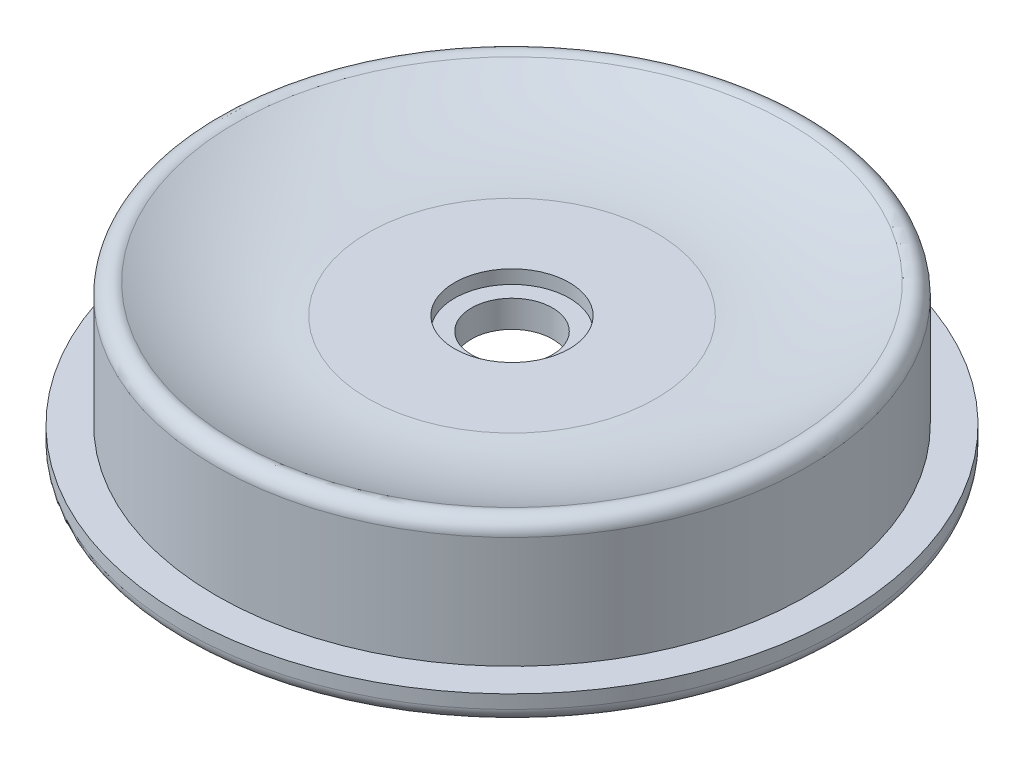
ISO-10303-21;
HEADER;
FILE_DESCRIPTION(('STEP AP214'),'2;1');
FILE_NAME('part.step','',(''),(''),'','','');
FILE_SCHEMA(('AUTOMOTIVE_DESIGN { 1 0 10303 214 1 1 1 1 }'));
ENDSEC;
DATA;
#1=APPLICATION_CONTEXT('core data for automotive mechanical design processes');
#2=APPLICATION_PROTOCOL_DEFINITION('international standard','automotive_design',2000,#1);
#3=PRODUCT_CONTEXT('',#1,'mechanical');
#4=PRODUCT('Part','Part','',(#3));
#5=PRODUCT_RELATED_PRODUCT_CATEGORY('part','',(#4));
#6=PRODUCT_DEFINITION_FORMATION('','',#4);
#7=PRODUCT_DEFINITION_CONTEXT('part definition',#1,'design');
#8=PRODUCT_DEFINITION('design','',#6,#7);
#9=PRODUCT_DEFINITION_SHAPE('','',#8);
#10=(LENGTH_UNIT() NAMED_UNIT(*) SI_UNIT(.MILLI.,.METRE.));
#11=(NAMED_UNIT(*) PLANE_ANGLE_UNIT() SI_UNIT($,.RADIAN.));
#12=(NAMED_UNIT(*) SI_UNIT($,.STERADIAN.) SOLID_ANGLE_UNIT());
#13=UNCERTAINTY_MEASURE_WITH_UNIT(LENGTH_MEASURE(1.E-05),#10,'distance_accuracy_value','');
#14=(GEOMETRIC_REPRESENTATION_CONTEXT(3) GLOBAL_UNCERTAINTY_ASSIGNED_CONTEXT((#13)) GLOBAL_UNIT_ASSIGNED_CONTEXT((#10,
#11,#12)) REPRESENTATION_CONTEXT('',''));
#15=CARTESIAN_POINT('',(0.,0.,0.));
#16=DIRECTION('',(0.,0.,1.));
#17=DIRECTION('',(1.,0.,0.));
#18=AXIS2_PLACEMENT_3D('',#15,#16,#17);
#19=CARTESIAN_POINT('',(48.8,4.,0.));
#20=DIRECTION('',(0.,-1.,0.));
#21=DIRECTION('',(0.,0.,-1.));
#22=AXIS2_PLACEMENT_3D('',#19,#20,#21);
#23=PLANE('',#22);
#24=CARTESIAN_POINT('',(0.,4.,0.));
#25=DIRECTION('',(0.,1.,0.));
#26=DIRECTION('',(0.,0.,1.));
#27=AXIS2_PLACEMENT_3D('',#24,#25,#26);
#28=CIRCLE('',#27,43.8);
#29=CARTESIAN_POINT('',(0.,4.,43.8));
#30=VERTEX_POINT('',#29);
#31=EDGE_CURVE('E50',#30,#30,#28,.T.);
#32=ORIENTED_EDGE('',*,*,#31,.F.);
#33=EDGE_LOOP('',(#32));
#34=FACE_BOUND('',#33,.T.);
#35=CARTESIAN_POINT('',(0.,4.,0.));
#36=DIRECTION('',(0.,1.,0.));
#37=DIRECTION('',(0.,0.,1.));
#38=AXIS2_PLACEMENT_3D('',#35,#36,#37);
#39=CIRCLE('',#38,48.8);
#40=CARTESIAN_POINT('',(0.,4.,48.8));
#41=VERTEX_POINT('',#40);
#42=EDGE_CURVE('E97',#41,#41,#39,.T.);
#43=ORIENTED_EDGE('',*,*,#42,.T.);
#44=EDGE_LOOP('',(#43));
#45=FACE_BOUND('',#44,.T.);
#46=ADVANCED_FACE('F37',(#34,#45),#23,.F.);
#47=CARTESIAN_POINT('',(0.,55.,0.));
#48=DIRECTION('',(0.,1.,0.));
#49=DIRECTION('',(0.,0.,1.));
#50=AXIS2_PLACEMENT_3D('',#47,#48,#49);
#51=CYLINDRICAL_SURFACE('',#50,43.8);
#52=CARTESIAN_POINT('',(0.,20.522937023034,0.));
#53=DIRECTION('',(0.,1.,0.));
#54=DIRECTION('',(0.,0.,1.));
#55=AXIS2_PLACEMENT_3D('',#52,#53,#54);
#56=CIRCLE('',#55,43.8);
#57=CARTESIAN_POINT('',(0.,20.522937023034,43.8));
#58=VERTEX_POINT('',#57);
#59=EDGE_CURVE('E55',#58,#58,#56,.T.);
#60=ORIENTED_EDGE('',*,*,#59,.F.);
#61=EDGE_LOOP('',(#60));
#62=FACE_BOUND('',#61,.T.);
#63=ORIENTED_EDGE('',*,*,#31,.T.);
#64=EDGE_LOOP('',(#63));
#65=FACE_BOUND('',#64,.T.);
#66=ADVANCED_FACE('F125',(#62,#65),#51,.T.);
#67=CARTESIAN_POINT('',(0.,20.522937023034,0.));
#68=DIRECTION('',(0.,1.,0.));
#69=DIRECTION('',(0.,0.,1.));
#70=AXIS2_PLACEMENT_3D('',#67,#68,#69);
#71=TOROIDAL_SURFACE('',#70,41.8,2.);
#72=CARTESIAN_POINT('',(0.,22.294338654817,0.));
#73=DIRECTION('',(0.,1.,0.));
#74=DIRECTION('',(0.,0.,1.));
#75=AXIS2_PLACEMENT_3D('',#72,#73,#74);
#76=CIRCLE('',#75,40.8714870712174);
#77=CARTESIAN_POINT('',(0.,22.294338654817,40.8714870712174));
#78=VERTEX_POINT('',#77);
#79=EDGE_CURVE('E61',#78,#78,#76,.T.);
#80=ORIENTED_EDGE('',*,*,#79,.F.);
#81=EDGE_LOOP('',(#80));
#82=FACE_BOUND('',#81,.T.);
#83=ORIENTED_EDGE('',*,*,#59,.T.);
#84=EDGE_LOOP('',(#83));
#85=FACE_BOUND('',#84,.T.);
#86=ADVANCED_FACE('F130',(#82,#85),#71,.T.);
#87=CARTESIAN_POINT('',(0.,55.9509696586946,0.));
#88=DIRECTION('',(0.,1.,0.));
#89=DIRECTION('',(0.,0.,1.));
#90=AXIS2_PLACEMENT_3D('',#87,#88,#89);
#91=DEGENERATE_TOROIDAL_SURFACE('',#90,23.2297414243481,38.,.T.);
#92=CARTESIAN_POINT('',(0.,18.,0.));
#93=DIRECTION('',(0.,1.,0.));
#94=DIRECTION('',(0.,0.,1.));
#95=AXIS2_PLACEMENT_3D('',#92,#93,#94);
#96=CIRCLE('',#95,21.3);
#97=CARTESIAN_POINT('',(0.,18.,21.3));
#98=VERTEX_POINT('',#97);
#99=EDGE_CURVE('E65',#98,#98,#96,.T.);
#100=ORIENTED_EDGE('',*,*,#99,.F.);
#101=EDGE_LOOP('',(#100));
#102=FACE_BOUND('',#101,.T.);
#103=ORIENTED_EDGE('',*,*,#79,.T.);
#104=EDGE_LOOP('',(#103));
#105=FACE_BOUND('',#104,.T.);
#106=ADVANCED_FACE('F137',(#102,#105),#91,.F.);
#107=CARTESIAN_POINT('',(8.5,18.,0.));
#108=DIRECTION('',(0.,-1.,0.));
#109=DIRECTION('',(0.,0.,-1.));
#110=AXIS2_PLACEMENT_3D('',#107,#108,#109);
#111=PLANE('',#110);
#112=CARTESIAN_POINT('',(0.,18.,0.));
#113=DIRECTION('',(0.,1.,0.));
#114=DIRECTION('',(0.,0.,1.));
#115=AXIS2_PLACEMENT_3D('',#112,#113,#114);
#116=CIRCLE('',#115,8.5);
#117=CARTESIAN_POINT('',(0.,18.,8.5));
#118=VERTEX_POINT('',#117);
#119=EDGE_CURVE('E69',#118,#118,#116,.T.);
#120=ORIENTED_EDGE('',*,*,#119,.F.);
#121=EDGE_LOOP('',(#120));
#122=FACE_BOUND('',#121,.T.);
#123=ORIENTED_EDGE('',*,*,#99,.T.);
#124=EDGE_LOOP('',(#123));
#125=FACE_BOUND('',#124,.T.);
#126=ADVANCED_FACE('F141',(#122,#125),#111,.F.);
#127=CARTESIAN_POINT('',(0.,55.,0.));
#128=DIRECTION('',(0.,1.,0.));
#129=DIRECTION('',(0.,0.,1.));
#130=AXIS2_PLACEMENT_3D('',#127,#128,#129);
#131=CYLINDRICAL_SURFACE('',#130,8.5);
#132=CARTESIAN_POINT('',(0.,16.,0.));
#133=DIRECTION('',(0.,1.,0.));
#134=DIRECTION('',(0.,0.,1.));
#135=AXIS2_PLACEMENT_3D('',#132,#133,#134);
#136=CIRCLE('',#135,8.5);
#137=CARTESIAN_POINT('',(0.,16.,8.5));
#138=VERTEX_POINT('',#137);
#139=EDGE_CURVE('E73',#138,#138,#136,.T.);
#140=ORIENTED_EDGE('',*,*,#139,.F.);
#141=EDGE_LOOP('',(#140));
#142=FACE_BOUND('',#141,.T.);
#143=ORIENTED_EDGE('',*,*,#119,.T.);
#144=EDGE_LOOP('',(#143));
#145=FACE_BOUND('',#144,.T.);
#146=ADVANCED_FACE('F145',(#142,#145),#131,.F.);
#147=CARTESIAN_POINT('',(8.5,16.,0.));
#148=DIRECTION('',(0.,-1.,0.));
#149=DIRECTION('',(0.,0.,-1.));
#150=AXIS2_PLACEMENT_3D('',#147,#148,#149);
#151=PLANE('',#150);
#152=CARTESIAN_POINT('',(0.,16.,0.));
#153=DIRECTION('',(0.,1.,0.));
#154=DIRECTION('',(0.,0.,1.));
#155=AXIS2_PLACEMENT_3D('',#152,#153,#154);
#156=CIRCLE('',#155,6.);
#157=CARTESIAN_POINT('',(0.,16.,6.));
#158=VERTEX_POINT('',#157);
#159=EDGE_CURVE('E77',#158,#158,#156,.T.);
#160=ORIENTED_EDGE('',*,*,#159,.F.);
#161=EDGE_LOOP('',(#160));
#162=FACE_BOUND('',#161,.T.);
#163=ORIENTED_EDGE('',*,*,#139,.T.);
#164=EDGE_LOOP('',(#163));
#165=FACE_BOUND('',#164,.T.);
#166=ADVANCED_FACE('F149',(#162,#165),#151,.F.);
#167=CARTESIAN_POINT('',(0.,55.,0.));
#168=DIRECTION('',(0.,1.,0.));
#169=DIRECTION('',(0.,0.,1.));
#170=AXIS2_PLACEMENT_3D('',#167,#168,#169);
#171=CYLINDRICAL_SURFACE('',#170,6.);
#172=CARTESIAN_POINT('',(0.,12.,0.));
#173=DIRECTION('',(0.,1.,0.));
#174=DIRECTION('',(0.,0.,1.));
#175=AXIS2_PLACEMENT_3D('',#172,#173,#174);
#176=CIRCLE('',#175,6.);
#177=CARTESIAN_POINT('',(0.,12.,6.));
#178=VERTEX_POINT('',#177);
#179=EDGE_CURVE('E81',#178,#178,#176,.T.);
#180=ORIENTED_EDGE('',*,*,#179,.F.);
#181=EDGE_LOOP('',(#180));
#182=FACE_BOUND('',#181,.T.);
#183=ORIENTED_EDGE('',*,*,#159,.T.);
#184=EDGE_LOOP('',(#183));
#185=FACE_BOUND('',#184,.T.);
#186=ADVANCED_FACE('F153',(#182,#185),#171,.F.);
#187=CARTESIAN_POINT('',(6.,12.,0.));
#188=DIRECTION('',(0.,1.,0.));
#189=DIRECTION('',(0.,0.,1.));
#190=AXIS2_PLACEMENT_3D('',#187,#188,#189);
#191=PLANE('',#190);
#192=CARTESIAN_POINT('',(0.,12.,0.));
#193=DIRECTION('',(0.,1.,0.));
#194=DIRECTION('',(0.,0.,1.));
#195=AXIS2_PLACEMENT_3D('',#192,#193,#194);
#196=CIRCLE('',#195,29.);
#197=CARTESIAN_POINT('',(0.,12.,29.));
#198=VERTEX_POINT('',#197);
#199=EDGE_CURVE('E85',#198,#198,#196,.T.);
#200=ORIENTED_EDGE('',*,*,#199,.F.);
#201=EDGE_LOOP('',(#200));
#202=FACE_BOUND('',#201,.T.);
#203=ORIENTED_EDGE('',*,*,#179,.T.);
#204=EDGE_LOOP('',(#203));
#205=FACE_BOUND('',#204,.T.);
#206=ADVANCED_FACE('F122',(#202,#205),#191,.F.);
#207=CARTESIAN_POINT('',(0.,55.,0.));
#208=DIRECTION('',(0.,1.,0.));
#209=DIRECTION('',(0.,0.,1.));
#210=AXIS2_PLACEMENT_3D('',#207,#208,#209);
#211=CYLINDRICAL_SURFACE('',#210,29.);
#212=CARTESIAN_POINT('',(0.,10.,0.));
#213=DIRECTION('',(0.,1.,0.));
#214=DIRECTION('',(0.,0.,1.));
#215=AXIS2_PLACEMENT_3D('',#212,#213,#214);
#216=CIRCLE('',#215,29.);
#217=CARTESIAN_POINT('',(0.,10.,29.));
#218=VERTEX_POINT('',#217);
#219=EDGE_CURVE('E10',#218,#218,#216,.F.);
#220=ORIENTED_EDGE('',*,*,#219,.T.);
#221=EDGE_LOOP('',(#220));
#222=FACE_BOUND('',#221,.T.);
#223=ORIENTED_EDGE('',*,*,#199,.T.);
#224=EDGE_LOOP('',(#223));
#225=FACE_BOUND('',#224,.T.);
#226=ADVANCED_FACE('F117',(#222,#225),#211,.F.);
#227=CARTESIAN_POINT('',(29.,0.,0.));
#228=DIRECTION('',(0.,1.,0.));
#229=DIRECTION('',(0.,0.,1.));
#230=AXIS2_PLACEMENT_3D('',#227,#228,#229);
#231=PLANE('',#230);
#232=CARTESIAN_POINT('',(0.,0.,0.));
#233=DIRECTION('',(0.,1.,0.));
#234=DIRECTION('',(0.,0.,1.));
#235=AXIS2_PLACEMENT_3D('',#232,#233,#234);
#236=CIRCLE('',#235,39.);
#237=CARTESIAN_POINT('',(0.,0.,39.));
#238=VERTEX_POINT('',#237);
#239=EDGE_CURVE('E45',#238,#238,#236,.T.);
#240=ORIENTED_EDGE('',*,*,#239,.T.);
#241=EDGE_LOOP('',(#240));
#242=FACE_BOUND('',#241,.T.);
#243=CARTESIAN_POINT('',(0.,0.,0.));
#244=DIRECTION('',(0.,1.,0.));
#245=DIRECTION('',(0.,0.,1.));
#246=AXIS2_PLACEMENT_3D('',#243,#244,#245);
#247=CIRCLE('',#246,46.8);
#248=CARTESIAN_POINT('',(0.,0.,46.8));
#249=VERTEX_POINT('',#248);
#250=EDGE_CURVE('E89',#249,#249,#247,.T.);
#251=ORIENTED_EDGE('',*,*,#250,.F.);
#252=EDGE_LOOP('',(#251));
#253=FACE_BOUND('',#252,.T.);
#254=ADVANCED_FACE('F112',(#242,#253),#231,.F.);
#255=CARTESIAN_POINT('',(0.,2.,0.));
#256=DIRECTION('',(0.,1.,0.));
#257=DIRECTION('',(0.,0.,1.));
#258=AXIS2_PLACEMENT_3D('',#255,#256,#257);
#259=TOROIDAL_SURFACE('',#258,46.8,2.);
#260=CARTESIAN_POINT('',(0.,2.,0.));
#261=DIRECTION('',(0.,1.,0.));
#262=DIRECTION('',(0.,0.,1.));
#263=AXIS2_PLACEMENT_3D('',#260,#261,#262);
#264=CIRCLE('',#263,48.8);
#265=CARTESIAN_POINT('',(0.,2.,48.8));
#266=VERTEX_POINT('',#265);
#267=EDGE_CURVE('E93',#266,#266,#264,.T.);
#268=ORIENTED_EDGE('',*,*,#267,.F.);
#269=EDGE_LOOP('',(#268));
#270=FACE_BOUND('',#269,.T.);
#271=ORIENTED_EDGE('',*,*,#250,.T.);
#272=EDGE_LOOP('',(#271));
#273=FACE_BOUND('',#272,.T.);
#274=ADVANCED_FACE('F106',(#270,#273),#259,.T.);
#275=CARTESIAN_POINT('',(0.,55.,0.));
#276=DIRECTION('',(0.,1.,0.));
#277=DIRECTION('',(0.,0.,1.));
#278=AXIS2_PLACEMENT_3D('',#275,#276,#277);
#279=CYLINDRICAL_SURFACE('',#278,48.8);
#280=ORIENTED_EDGE('',*,*,#42,.F.);
#281=EDGE_LOOP('',(#280));
#282=FACE_BOUND('',#281,.T.);
#283=ORIENTED_EDGE('',*,*,#267,.T.);
#284=EDGE_LOOP('',(#283));
#285=FACE_BOUND('',#284,.T.);
#286=ADVANCED_FACE('F103',(#282,#285),#279,.T.);
#287=CARTESIAN_POINT('',(0.,10.,0.));
#288=DIRECTION('',(0.,1.,0.));
#289=DIRECTION('',(0.,0.,1.));
#290=AXIS2_PLACEMENT_3D('',#287,#288,#289);
#291=TOROIDAL_SURFACE('',#290,39.,10.);
#292=ORIENTED_EDGE('',*,*,#219,.F.);
#293=EDGE_LOOP('',(#292));
#294=FACE_BOUND('',#293,.T.);
#295=ORIENTED_EDGE('',*,*,#239,.F.);
#296=EDGE_LOOP('',(#295));
#297=FACE_BOUND('',#296,.T.);
#298=ADVANCED_FACE('F39',(#294,#297),#291,.T.);
#299=CLOSED_SHELL('',(#46,#66,#86,#106,#126,#146,#166,#186,#206,#226,#254,#274,#286,#298));
#300=MANIFOLD_SOLID_BREP('B2',#299);
#301=ADVANCED_BREP_SHAPE_REPRESENTATION('',(#18,#300),#14);
#302=SHAPE_DEFINITION_REPRESENTATION(#9,#301);
ENDSEC;
END-ISO-10303-21;
